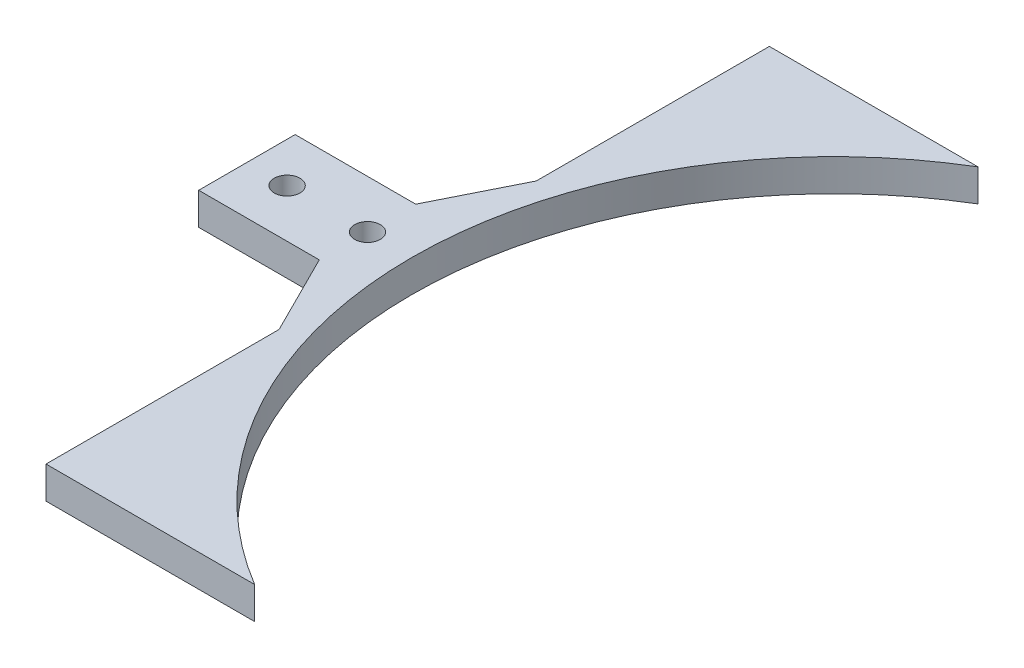
ISO-10303-21;
HEADER;
FILE_DESCRIPTION(('STEP AP214'),'2;1');
FILE_NAME('part.step','',(''),(''),'','','');
FILE_SCHEMA(('AUTOMOTIVE_DESIGN { 1 0 10303 214 1 1 1 1 }'));
ENDSEC;
DATA;
#1=APPLICATION_CONTEXT('core data for automotive mechanical design processes');
#2=APPLICATION_PROTOCOL_DEFINITION('international standard','automotive_design',2000,#1);
#3=PRODUCT_CONTEXT('',#1,'mechanical');
#4=PRODUCT('Part','Part','',(#3));
#5=PRODUCT_RELATED_PRODUCT_CATEGORY('part','',(#4));
#6=PRODUCT_DEFINITION_FORMATION('','',#4);
#7=PRODUCT_DEFINITION_CONTEXT('part definition',#1,'design');
#8=PRODUCT_DEFINITION('design','',#6,#7);
#9=PRODUCT_DEFINITION_SHAPE('','',#8);
#10=(LENGTH_UNIT() NAMED_UNIT(*) SI_UNIT(.MILLI.,.METRE.));
#11=(NAMED_UNIT(*) PLANE_ANGLE_UNIT() SI_UNIT($,.RADIAN.));
#12=(NAMED_UNIT(*) SI_UNIT($,.STERADIAN.) SOLID_ANGLE_UNIT());
#13=UNCERTAINTY_MEASURE_WITH_UNIT(LENGTH_MEASURE(1.E-05),#10,'distance_accuracy_value','');
#14=(GEOMETRIC_REPRESENTATION_CONTEXT(3) GLOBAL_UNCERTAINTY_ASSIGNED_CONTEXT((#13)) GLOBAL_UNIT_ASSIGNED_CONTEXT((#10,
#11,#12)) REPRESENTATION_CONTEXT('',''));
#15=CARTESIAN_POINT('',(0.,0.,0.));
#16=DIRECTION('',(0.,0.,1.));
#17=DIRECTION('',(1.,0.,0.));
#18=AXIS2_PLACEMENT_3D('',#15,#16,#17);
#19=CARTESIAN_POINT('',(31.7351044809231,4.,-1.80925648091944));
#20=DIRECTION('',(0.,1.,0.));
#21=DIRECTION('',(0.,0.,1.));
#22=AXIS2_PLACEMENT_3D('',#19,#20,#21);
#23=PLANE('',#22);
#24=CARTESIAN_POINT('',(-36.2648955190769,4.,-1.80925648091943));
#25=DIRECTION('',(0.,1.,0.));
#26=DIRECTION('',(0.,0.,1.));
#27=AXIS2_PLACEMENT_3D('',#24,#25,#26);
#28=CIRCLE('',#27,1.6);
#29=CARTESIAN_POINT('',(-36.2648955190769,4.,-0.209256480919433));
#30=VERTEX_POINT('',#29);
#31=EDGE_CURVE('E162',#30,#30,#28,.T.);
#32=ORIENTED_EDGE('',*,*,#31,.F.);
#33=EDGE_LOOP('',(#32));
#34=FACE_BOUND('',#33,.T.);
#35=DIRECTION('',(0.,0.,1.));
#36=VECTOR('',#35,1.);
#37=CARTESIAN_POINT('',(-41.2648955190769,4.,-7.80925648091944));
#38=LINE('',#37,#36);
#39=CARTESIAN_POINT('',(-41.2648955190769,4.,-7.80925648091944));
#40=VERTEX_POINT('',#39);
#41=CARTESIAN_POINT('',(-41.2648955190769,4.,4.19074351908054));
#42=VERTEX_POINT('',#41);
#43=EDGE_CURVE('E186',#40,#42,#38,.T.);
#44=ORIENTED_EDGE('',*,*,#43,.T.);
#45=DIRECTION('',(1.,0.,0.));
#46=VECTOR('',#45,1.);
#47=CARTESIAN_POINT('',(-41.2648955190769,4.,4.19074351908054));
#48=LINE('',#47,#46);
#49=CARTESIAN_POINT('',(-26.2648955190769,4.,4.19074351908055));
#50=VERTEX_POINT('',#49);
#51=EDGE_CURVE('E110',#42,#50,#48,.T.);
#52=ORIENTED_EDGE('',*,*,#51,.T.);
#53=DIRECTION('',(0.447213595499958,0.,0.894427190999916));
#54=VECTOR('',#53,1.);
#55=CARTESIAN_POINT('',(-26.2648955190769,4.,4.19074351908055));
#56=LINE('',#55,#54);
#57=CARTESIAN_POINT('',(-21.2648955190769,4.,14.1907435190806));
#58=VERTEX_POINT('',#57);
#59=EDGE_CURVE('E215',#50,#58,#56,.T.);
#60=ORIENTED_EDGE('',*,*,#59,.T.);
#61=DIRECTION('',(0.,0.,1.));
#62=VECTOR('',#61,1.);
#63=CARTESIAN_POINT('',(-21.2648955190769,4.,14.1907435190806));
#64=LINE('',#63,#62);
#65=CARTESIAN_POINT('',(-21.2648955190769,4.,43.1907435190806));
#66=VERTEX_POINT('',#65);
#67=EDGE_CURVE('E235',#58,#66,#64,.T.);
#68=ORIENTED_EDGE('',*,*,#67,.T.);
#69=DIRECTION('',(1.,0.,0.));
#70=VECTOR('',#69,1.);
#71=CARTESIAN_POINT('',(-21.2648955190769,4.,43.1907435190806));
#72=LINE('',#71,#70);
#73=CARTESIAN_POINT('',(4.69346991494314,4.,43.1907435190805));
#74=VERTEX_POINT('',#73);
#75=EDGE_CURVE('E231',#66,#74,#72,.T.);
#76=ORIENTED_EDGE('',*,*,#75,.T.);
#77=CARTESIAN_POINT('',(31.7351044809231,4.,-1.80925648091944));
#78=DIRECTION('',(0.,-1.,0.));
#79=DIRECTION('',(0.,0.,1.));
#80=AXIS2_PLACEMENT_3D('',#77,#78,#79);
#81=CIRCLE('',#80,52.5);
#82=CARTESIAN_POINT('',(4.69346991494314,4.,-46.8092564809194));
#83=VERTEX_POINT('',#82);
#84=EDGE_CURVE('E234',#74,#83,#81,.T.);
#85=ORIENTED_EDGE('',*,*,#84,.T.);
#86=DIRECTION('',(-1.,0.,0.));
#87=VECTOR('',#86,1.);
#88=CARTESIAN_POINT('',(-21.2648955190769,4.,-46.8092564809194));
#89=LINE('',#88,#87);
#90=CARTESIAN_POINT('',(-21.2648955190769,4.,-46.8092564809194));
#91=VERTEX_POINT('',#90);
#92=EDGE_CURVE('E135',#83,#91,#89,.T.);
#93=ORIENTED_EDGE('',*,*,#92,.T.);
#94=DIRECTION('',(0.,0.,1.));
#95=VECTOR('',#94,1.);
#96=CARTESIAN_POINT('',(-21.2648955190769,4.,-46.8092564809194));
#97=LINE('',#96,#95);
#98=CARTESIAN_POINT('',(-21.2648955190769,4.,-17.8092564809194));
#99=VERTEX_POINT('',#98);
#100=EDGE_CURVE('E129',#91,#99,#97,.T.);
#101=ORIENTED_EDGE('',*,*,#100,.T.);
#102=DIRECTION('',(-0.447213595499958,0.,0.894427190999916));
#103=VECTOR('',#102,1.);
#104=CARTESIAN_POINT('',(-26.2648955190769,4.,-7.80925648091944));
#105=LINE('',#104,#103);
#106=CARTESIAN_POINT('',(-26.2648955190769,4.,-7.80925648091944));
#107=VERTEX_POINT('',#106);
#108=EDGE_CURVE('E133',#99,#107,#105,.T.);
#109=ORIENTED_EDGE('',*,*,#108,.T.);
#110=DIRECTION('',(-1.,0.,0.));
#111=VECTOR('',#110,1.);
#112=CARTESIAN_POINT('',(-41.2648955190769,4.,-7.80925648091944));
#113=LINE('',#112,#111);
#114=EDGE_CURVE('E61',#107,#40,#113,.T.);
#115=ORIENTED_EDGE('',*,*,#114,.T.);
#116=EDGE_LOOP('',(#44,#52,#60,#68,#76,#85,#93,#101,#109,#115));
#117=FACE_BOUND('',#116,.T.);
#118=CARTESIAN_POINT('',(-26.2648955190769,4.,-1.80925648091943));
#119=DIRECTION('',(0.,1.,0.));
#120=DIRECTION('',(0.,0.,1.));
#121=AXIS2_PLACEMENT_3D('',#118,#119,#120);
#122=CIRCLE('',#121,1.6);
#123=CARTESIAN_POINT('',(-26.2648955190769,4.,-0.209256480919432));
#124=VERTEX_POINT('',#123);
#125=EDGE_CURVE('E253',#124,#124,#122,.T.);
#126=ORIENTED_EDGE('',*,*,#125,.F.);
#127=EDGE_LOOP('',(#126));
#128=FACE_BOUND('',#127,.T.);
#129=ADVANCED_FACE('F43',(#34,#117,#128),#23,.T.);
#130=CARTESIAN_POINT('',(31.7351044809231,0.,-1.80925648091944));
#131=DIRECTION('',(0.,1.,0.));
#132=DIRECTION('',(0.,0.,1.));
#133=AXIS2_PLACEMENT_3D('',#130,#131,#132);
#134=PLANE('',#133);
#135=DIRECTION('',(0.,0.,1.));
#136=VECTOR('',#135,1.);
#137=CARTESIAN_POINT('',(-41.2648955190769,0.,-7.80925648091944));
#138=LINE('',#137,#136);
#139=CARTESIAN_POINT('',(-41.2648955190769,0.,-7.80925648091944));
#140=VERTEX_POINT('',#139);
#141=CARTESIAN_POINT('',(-41.2648955190769,0.,4.19074351908054));
#142=VERTEX_POINT('',#141);
#143=EDGE_CURVE('E157',#140,#142,#138,.T.);
#144=ORIENTED_EDGE('',*,*,#143,.F.);
#145=DIRECTION('',(-1.,0.,0.));
#146=VECTOR('',#145,1.);
#147=CARTESIAN_POINT('',(-41.2648955190769,0.,-7.80925648091944));
#148=LINE('',#147,#146);
#149=CARTESIAN_POINT('',(-26.2648955190769,0.,-7.80925648091944));
#150=VERTEX_POINT('',#149);
#151=EDGE_CURVE('E102',#150,#140,#148,.T.);
#152=ORIENTED_EDGE('',*,*,#151,.F.);
#153=DIRECTION('',(-0.447213595499958,0.,0.894427190999916));
#154=VECTOR('',#153,1.);
#155=CARTESIAN_POINT('',(-26.2648955190769,0.,-7.80925648091944));
#156=LINE('',#155,#154);
#157=CARTESIAN_POINT('',(-21.2648955190769,0.,-17.8092564809194));
#158=VERTEX_POINT('',#157);
#159=EDGE_CURVE('E96',#158,#150,#156,.T.);
#160=ORIENTED_EDGE('',*,*,#159,.F.);
#161=DIRECTION('',(0.,0.,1.));
#162=VECTOR('',#161,1.);
#163=CARTESIAN_POINT('',(-21.2648955190769,0.,-46.8092564809194));
#164=LINE('',#163,#162);
#165=CARTESIAN_POINT('',(-21.2648955190769,0.,-46.8092564809194));
#166=VERTEX_POINT('',#165);
#167=EDGE_CURVE('E144',#166,#158,#164,.T.);
#168=ORIENTED_EDGE('',*,*,#167,.F.);
#169=DIRECTION('',(-1.,0.,0.));
#170=VECTOR('',#169,1.);
#171=CARTESIAN_POINT('',(-21.2648955190769,0.,-46.8092564809194));
#172=LINE('',#171,#170);
#173=CARTESIAN_POINT('',(4.69346991494314,0.,-46.8092564809194));
#174=VERTEX_POINT('',#173);
#175=EDGE_CURVE('E177',#174,#166,#172,.T.);
#176=ORIENTED_EDGE('',*,*,#175,.F.);
#177=CARTESIAN_POINT('',(31.7351044809231,0.,-1.80925648091944));
#178=DIRECTION('',(0.,-1.,0.));
#179=DIRECTION('',(0.,0.,1.));
#180=AXIS2_PLACEMENT_3D('',#177,#178,#179);
#181=CIRCLE('',#180,52.5);
#182=CARTESIAN_POINT('',(4.69346991494314,0.,43.1907435190805));
#183=VERTEX_POINT('',#182);
#184=EDGE_CURVE('E174',#183,#174,#181,.T.);
#185=ORIENTED_EDGE('',*,*,#184,.F.);
#186=DIRECTION('',(1.,0.,0.));
#187=VECTOR('',#186,1.);
#188=CARTESIAN_POINT('',(-21.2648955190769,0.,43.1907435190806));
#189=LINE('',#188,#187);
#190=CARTESIAN_POINT('',(-21.2648955190769,0.,43.1907435190806));
#191=VERTEX_POINT('',#190);
#192=EDGE_CURVE('E171',#191,#183,#189,.T.);
#193=ORIENTED_EDGE('',*,*,#192,.F.);
#194=DIRECTION('',(0.,0.,1.));
#195=VECTOR('',#194,1.);
#196=CARTESIAN_POINT('',(-21.2648955190769,0.,14.1907435190806));
#197=LINE('',#196,#195);
#198=CARTESIAN_POINT('',(-21.2648955190769,0.,14.1907435190806));
#199=VERTEX_POINT('',#198);
#200=EDGE_CURVE('E168',#199,#191,#197,.T.);
#201=ORIENTED_EDGE('',*,*,#200,.F.);
#202=DIRECTION('',(0.447213595499958,0.,0.894427190999916));
#203=VECTOR('',#202,1.);
#204=CARTESIAN_POINT('',(-26.2648955190769,0.,4.19074351908055));
#205=LINE('',#204,#203);
#206=CARTESIAN_POINT('',(-26.2648955190769,0.,4.19074351908055));
#207=VERTEX_POINT('',#206);
#208=EDGE_CURVE('E165',#207,#199,#205,.T.);
#209=ORIENTED_EDGE('',*,*,#208,.F.);
#210=DIRECTION('',(1.,0.,0.));
#211=VECTOR('',#210,1.);
#212=CARTESIAN_POINT('',(-41.2648955190769,0.,4.19074351908054));
#213=LINE('',#212,#211);
#214=EDGE_CURVE('E161',#142,#207,#213,.T.);
#215=ORIENTED_EDGE('',*,*,#214,.F.);
#216=EDGE_LOOP('',(#144,#152,#160,#168,#176,#185,#193,#201,#209,#215));
#217=FACE_BOUND('',#216,.T.);
#218=CARTESIAN_POINT('',(-36.2648955190769,0.,-1.80925648091943));
#219=DIRECTION('',(0.,1.,0.));
#220=DIRECTION('',(0.,0.,1.));
#221=AXIS2_PLACEMENT_3D('',#218,#219,#220);
#222=CIRCLE('',#221,1.6);
#223=CARTESIAN_POINT('',(-36.2648955190769,0.,-0.209256480919433));
#224=VERTEX_POINT('',#223);
#225=EDGE_CURVE('E249',#224,#224,#222,.T.);
#226=ORIENTED_EDGE('',*,*,#225,.T.);
#227=EDGE_LOOP('',(#226));
#228=FACE_BOUND('',#227,.T.);
#229=CARTESIAN_POINT('',(-26.2648955190769,0.,-1.80925648091943));
#230=DIRECTION('',(0.,1.,0.));
#231=DIRECTION('',(0.,0.,1.));
#232=AXIS2_PLACEMENT_3D('',#229,#230,#231);
#233=CIRCLE('',#232,1.6);
#234=CARTESIAN_POINT('',(-26.2648955190769,0.,-0.209256480919432));
#235=VERTEX_POINT('',#234);
#236=EDGE_CURVE('E257',#235,#235,#233,.T.);
#237=ORIENTED_EDGE('',*,*,#236,.T.);
#238=EDGE_LOOP('',(#237));
#239=FACE_BOUND('',#238,.T.);
#240=ADVANCED_FACE('F219',(#217,#228,#239),#134,.F.);
#241=CARTESIAN_POINT('',(-41.2648955190769,4.,-7.80925648091944));
#242=DIRECTION('',(1.,0.,0.));
#243=DIRECTION('',(0.,0.,-1.));
#244=AXIS2_PLACEMENT_3D('',#241,#242,#243);
#245=PLANE('',#244);
#246=ORIENTED_EDGE('',*,*,#143,.T.);
#247=DIRECTION('',(0.,-1.,0.));
#248=VECTOR('',#247,1.);
#249=CARTESIAN_POINT('',(-41.2648955190769,4.,4.19074351908054));
#250=LINE('',#249,#248);
#251=EDGE_CURVE('E11',#42,#142,#250,.T.);
#252=ORIENTED_EDGE('',*,*,#251,.F.);
#253=ORIENTED_EDGE('',*,*,#43,.F.);
#254=DIRECTION('',(0.,-1.,0.));
#255=VECTOR('',#254,1.);
#256=CARTESIAN_POINT('',(-41.2648955190769,4.,-7.80925648091944));
#257=LINE('',#256,#255);
#258=EDGE_CURVE('E153',#40,#140,#257,.T.);
#259=ORIENTED_EDGE('',*,*,#258,.T.);
#260=EDGE_LOOP('',(#246,#252,#253,#259));
#261=FACE_BOUND('',#260,.T.);
#262=ADVANCED_FACE('F45',(#261),#245,.F.);
#263=CARTESIAN_POINT('',(-41.2648955190769,4.,4.19074351908054));
#264=DIRECTION('',(0.,0.,-1.));
#265=DIRECTION('',(-1.,0.,0.));
#266=AXIS2_PLACEMENT_3D('',#263,#264,#265);
#267=PLANE('',#266);
#268=ORIENTED_EDGE('',*,*,#214,.T.);
#269=DIRECTION('',(0.,-1.,0.));
#270=VECTOR('',#269,1.);
#271=CARTESIAN_POINT('',(-26.2648955190769,4.,4.19074351908055));
#272=LINE('',#271,#270);
#273=EDGE_CURVE('E53',#50,#207,#272,.T.);
#274=ORIENTED_EDGE('',*,*,#273,.F.);
#275=ORIENTED_EDGE('',*,*,#51,.F.);
#276=ORIENTED_EDGE('',*,*,#251,.T.);
#277=EDGE_LOOP('',(#268,#274,#275,#276));
#278=FACE_BOUND('',#277,.T.);
#279=ADVANCED_FACE('F299',(#278),#267,.F.);
#280=CARTESIAN_POINT('',(-26.2648955190769,4.,4.19074351908055));
#281=DIRECTION('',(0.894427190999916,0.,-0.447213595499958));
#282=DIRECTION('',(-0.447213595499958,0.,-0.894427190999916));
#283=AXIS2_PLACEMENT_3D('',#280,#281,#282);
#284=PLANE('',#283);
#285=ORIENTED_EDGE('',*,*,#208,.T.);
#286=DIRECTION('',(0.,-1.,0.));
#287=VECTOR('',#286,1.);
#288=CARTESIAN_POINT('',(-21.2648955190769,4.,14.1907435190806));
#289=LINE('',#288,#287);
#290=EDGE_CURVE('E205',#58,#199,#289,.T.);
#291=ORIENTED_EDGE('',*,*,#290,.F.);
#292=ORIENTED_EDGE('',*,*,#59,.F.);
#293=ORIENTED_EDGE('',*,*,#273,.T.);
#294=EDGE_LOOP('',(#285,#291,#292,#293));
#295=FACE_BOUND('',#294,.T.);
#296=ADVANCED_FACE('F213',(#295),#284,.F.);
#297=CARTESIAN_POINT('',(-21.2648955190769,4.,14.1907435190806));
#298=DIRECTION('',(1.,0.,0.));
#299=DIRECTION('',(0.,0.,-1.));
#300=AXIS2_PLACEMENT_3D('',#297,#298,#299);
#301=PLANE('',#300);
#302=ORIENTED_EDGE('',*,*,#200,.T.);
#303=DIRECTION('',(0.,-1.,0.));
#304=VECTOR('',#303,1.);
#305=CARTESIAN_POINT('',(-21.2648955190769,4.,43.1907435190806));
#306=LINE('',#305,#304);
#307=EDGE_CURVE('E201',#66,#191,#306,.T.);
#308=ORIENTED_EDGE('',*,*,#307,.F.);
#309=ORIENTED_EDGE('',*,*,#67,.F.);
#310=ORIENTED_EDGE('',*,*,#290,.T.);
#311=EDGE_LOOP('',(#302,#308,#309,#310));
#312=FACE_BOUND('',#311,.T.);
#313=ADVANCED_FACE('F225',(#312),#301,.F.);
#314=CARTESIAN_POINT('',(-21.2648955190769,4.,43.1907435190806));
#315=DIRECTION('',(0.,0.,-1.));
#316=DIRECTION('',(-1.,0.,0.));
#317=AXIS2_PLACEMENT_3D('',#314,#315,#316);
#318=PLANE('',#317);
#319=ORIENTED_EDGE('',*,*,#192,.T.);
#320=DIRECTION('',(0.,-1.,0.));
#321=VECTOR('',#320,1.);
#322=CARTESIAN_POINT('',(4.69346991494314,4.,43.1907435190805));
#323=LINE('',#322,#321);
#324=EDGE_CURVE('E197',#74,#183,#323,.T.);
#325=ORIENTED_EDGE('',*,*,#324,.F.);
#326=ORIENTED_EDGE('',*,*,#75,.F.);
#327=ORIENTED_EDGE('',*,*,#307,.T.);
#328=EDGE_LOOP('',(#319,#325,#326,#327));
#329=FACE_BOUND('',#328,.T.);
#330=ADVANCED_FACE('F229',(#329),#318,.F.);
#331=CARTESIAN_POINT('',(31.7351044809231,4.,-1.80925648091944));
#332=DIRECTION('',(0.,-1.,0.));
#333=DIRECTION('',(0.,0.,-1.));
#334=AXIS2_PLACEMENT_3D('',#331,#332,#333);
#335=CYLINDRICAL_SURFACE('',#334,52.5);
#336=ORIENTED_EDGE('',*,*,#184,.T.);
#337=DIRECTION('',(0.,-1.,0.));
#338=VECTOR('',#337,1.);
#339=CARTESIAN_POINT('',(4.69346991494314,4.,-46.8092564809194));
#340=LINE('',#339,#338);
#341=EDGE_CURVE('E193',#83,#174,#340,.T.);
#342=ORIENTED_EDGE('',*,*,#341,.F.);
#343=ORIENTED_EDGE('',*,*,#84,.F.);
#344=ORIENTED_EDGE('',*,*,#324,.T.);
#345=EDGE_LOOP('',(#336,#342,#343,#344));
#346=FACE_BOUND('',#345,.T.);
#347=ADVANCED_FACE('F289',(#346),#335,.F.);
#348=CARTESIAN_POINT('',(-21.2648955190769,4.,-46.8092564809194));
#349=DIRECTION('',(0.,0.,1.));
#350=DIRECTION('',(1.,0.,0.));
#351=AXIS2_PLACEMENT_3D('',#348,#349,#350);
#352=PLANE('',#351);
#353=ORIENTED_EDGE('',*,*,#175,.T.);
#354=DIRECTION('',(0.,-1.,0.));
#355=VECTOR('',#354,1.);
#356=CARTESIAN_POINT('',(-21.2648955190769,4.,-46.8092564809194));
#357=LINE('',#356,#355);
#358=EDGE_CURVE('E146',#91,#166,#357,.T.);
#359=ORIENTED_EDGE('',*,*,#358,.F.);
#360=ORIENTED_EDGE('',*,*,#92,.F.);
#361=ORIENTED_EDGE('',*,*,#341,.T.);
#362=EDGE_LOOP('',(#353,#359,#360,#361));
#363=FACE_BOUND('',#362,.T.);
#364=ADVANCED_FACE('F286',(#363),#352,.F.);
#365=CARTESIAN_POINT('',(-21.2648955190769,4.,-46.8092564809194));
#366=DIRECTION('',(1.,0.,0.));
#367=DIRECTION('',(0.,0.,-1.));
#368=AXIS2_PLACEMENT_3D('',#365,#366,#367);
#369=PLANE('',#368);
#370=ORIENTED_EDGE('',*,*,#167,.T.);
#371=DIRECTION('',(0.,-1.,0.));
#372=VECTOR('',#371,1.);
#373=CARTESIAN_POINT('',(-21.2648955190769,4.,-17.8092564809194));
#374=LINE('',#373,#372);
#375=EDGE_CURVE('E141',#99,#158,#374,.T.);
#376=ORIENTED_EDGE('',*,*,#375,.F.);
#377=ORIENTED_EDGE('',*,*,#100,.F.);
#378=ORIENTED_EDGE('',*,*,#358,.T.);
#379=EDGE_LOOP('',(#370,#376,#377,#378));
#380=FACE_BOUND('',#379,.T.);
#381=ADVANCED_FACE('F142',(#380),#369,.F.);
#382=CARTESIAN_POINT('',(-26.2648955190769,4.,-7.80925648091944));
#383=DIRECTION('',(0.894427190999916,0.,0.447213595499958));
#384=DIRECTION('',(0.447213595499958,0.,-0.894427190999916));
#385=AXIS2_PLACEMENT_3D('',#382,#383,#384);
#386=PLANE('',#385);
#387=ORIENTED_EDGE('',*,*,#159,.T.);
#388=DIRECTION('',(0.,-1.,0.));
#389=VECTOR('',#388,1.);
#390=CARTESIAN_POINT('',(-26.2648955190769,4.,-7.80925648091944));
#391=LINE('',#390,#389);
#392=EDGE_CURVE('E147',#107,#150,#391,.T.);
#393=ORIENTED_EDGE('',*,*,#392,.F.);
#394=ORIENTED_EDGE('',*,*,#108,.F.);
#395=ORIENTED_EDGE('',*,*,#375,.T.);
#396=EDGE_LOOP('',(#387,#393,#394,#395));
#397=FACE_BOUND('',#396,.T.);
#398=ADVANCED_FACE('F149',(#397),#386,.F.);
#399=CARTESIAN_POINT('',(-41.2648955190769,4.,-7.80925648091944));
#400=DIRECTION('',(0.,0.,1.));
#401=DIRECTION('',(1.,0.,0.));
#402=AXIS2_PLACEMENT_3D('',#399,#400,#401);
#403=PLANE('',#402);
#404=ORIENTED_EDGE('',*,*,#151,.T.);
#405=ORIENTED_EDGE('',*,*,#258,.F.);
#406=ORIENTED_EDGE('',*,*,#114,.F.);
#407=ORIENTED_EDGE('',*,*,#392,.T.);
#408=EDGE_LOOP('',(#404,#405,#406,#407));
#409=FACE_BOUND('',#408,.T.);
#410=ADVANCED_FACE('F279',(#409),#403,.F.);
#411=CARTESIAN_POINT('',(-36.2648955190769,4.,-1.80925648091943));
#412=DIRECTION('',(0.,-1.,0.));
#413=DIRECTION('',(0.,0.,-1.));
#414=AXIS2_PLACEMENT_3D('',#411,#412,#413);
#415=CYLINDRICAL_SURFACE('',#414,1.6);
#416=ORIENTED_EDGE('',*,*,#31,.T.);
#417=EDGE_LOOP('',(#416));
#418=FACE_BOUND('',#417,.T.);
#419=ORIENTED_EDGE('',*,*,#225,.F.);
#420=EDGE_LOOP('',(#419));
#421=FACE_BOUND('',#420,.T.);
#422=ADVANCED_FACE('F276',(#418,#421),#415,.F.);
#423=CARTESIAN_POINT('',(-26.2648955190769,4.,-1.80925648091943));
#424=DIRECTION('',(0.,-1.,0.));
#425=DIRECTION('',(0.,0.,-1.));
#426=AXIS2_PLACEMENT_3D('',#423,#424,#425);
#427=CYLINDRICAL_SURFACE('',#426,1.6);
#428=ORIENTED_EDGE('',*,*,#125,.T.);
#429=EDGE_LOOP('',(#428));
#430=FACE_BOUND('',#429,.T.);
#431=ORIENTED_EDGE('',*,*,#236,.F.);
#432=EDGE_LOOP('',(#431));
#433=FACE_BOUND('',#432,.T.);
#434=ADVANCED_FACE('F265',(#430,#433),#427,.F.);
#435=CLOSED_SHELL('',(#129,#240,#262,#279,#296,#313,#330,#347,#364,#381,#398,#410,#422,#434));
#436=MANIFOLD_SOLID_BREP('B2',#435);
#437=ADVANCED_BREP_SHAPE_REPRESENTATION('',(#18,#436),#14);
#438=SHAPE_DEFINITION_REPRESENTATION(#9,#437);
ENDSEC;
END-ISO-10303-21;
